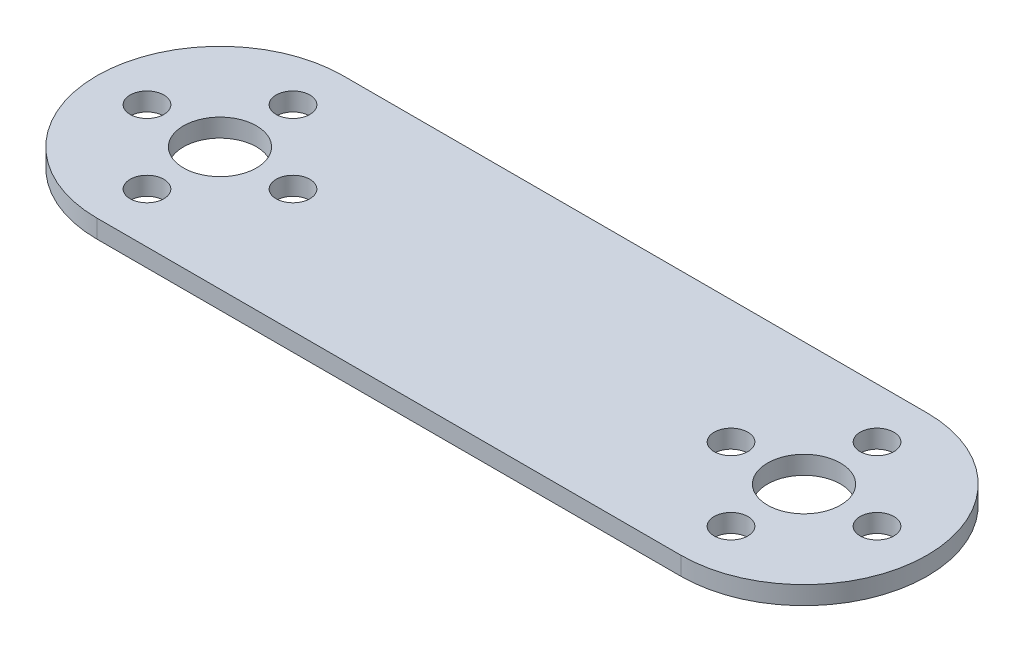
ISO-10303-21;
HEADER;
FILE_DESCRIPTION(('STEP AP214'),'2;1');
FILE_NAME('part.step','',(''),(''),'','','');
FILE_SCHEMA(('AUTOMOTIVE_DESIGN { 1 0 10303 214 1 1 1 1 }'));
ENDSEC;
DATA;
#1=APPLICATION_CONTEXT('core data for automotive mechanical design processes');
#2=APPLICATION_PROTOCOL_DEFINITION('international standard','automotive_design',2000,#1);
#3=PRODUCT_CONTEXT('',#1,'mechanical');
#4=PRODUCT('Part','Part','',(#3));
#5=PRODUCT_RELATED_PRODUCT_CATEGORY('part','',(#4));
#6=PRODUCT_DEFINITION_FORMATION('','',#4);
#7=PRODUCT_DEFINITION_CONTEXT('part definition',#1,'design');
#8=PRODUCT_DEFINITION('design','',#6,#7);
#9=PRODUCT_DEFINITION_SHAPE('','',#8);
#10=(LENGTH_UNIT() NAMED_UNIT(*) SI_UNIT(.MILLI.,.METRE.));
#11=(NAMED_UNIT(*) PLANE_ANGLE_UNIT() SI_UNIT($,.RADIAN.));
#12=(NAMED_UNIT(*) SI_UNIT($,.STERADIAN.) SOLID_ANGLE_UNIT());
#13=UNCERTAINTY_MEASURE_WITH_UNIT(LENGTH_MEASURE(1.E-05),#10,'distance_accuracy_value','');
#14=(GEOMETRIC_REPRESENTATION_CONTEXT(3) GLOBAL_UNCERTAINTY_ASSIGNED_CONTEXT((#13)) GLOBAL_UNIT_ASSIGNED_CONTEXT((#10,
#11,#12)) REPRESENTATION_CONTEXT('',''));
#15=CARTESIAN_POINT('',(0.,0.,0.));
#16=DIRECTION('',(0.,0.,1.));
#17=DIRECTION('',(1.,0.,0.));
#18=AXIS2_PLACEMENT_3D('',#15,#16,#17);
#19=CARTESIAN_POINT('',(64.,0.,0.));
#20=DIRECTION('',(0.,1.,0.));
#21=DIRECTION('',(0.,0.,1.));
#22=AXIS2_PLACEMENT_3D('',#19,#20,#21);
#23=CYLINDRICAL_SURFACE('',#22,13.5);
#24=CARTESIAN_POINT('',(64.,2.,0.));
#25=DIRECTION('',(0.,1.,0.));
#26=DIRECTION('',(0.,0.,1.));
#27=AXIS2_PLACEMENT_3D('',#24,#25,#26);
#28=CIRCLE('',#27,13.5);
#29=CARTESIAN_POINT('',(64.,2.,13.5));
#30=VERTEX_POINT('',#29);
#31=CARTESIAN_POINT('',(64.,2.,-13.5));
#32=VERTEX_POINT('',#31);
#33=EDGE_CURVE('E97',#30,#32,#28,.T.);
#34=ORIENTED_EDGE('',*,*,#33,.F.);
#35=DIRECTION('',(0.,1.,0.));
#36=VECTOR('',#35,1.);
#37=CARTESIAN_POINT('',(64.,0.,13.5));
#38=LINE('',#37,#36);
#39=CARTESIAN_POINT('',(64.,0.,13.5));
#40=VERTEX_POINT('',#39);
#41=EDGE_CURVE('E11',#40,#30,#38,.T.);
#42=ORIENTED_EDGE('',*,*,#41,.F.);
#43=CARTESIAN_POINT('',(64.,0.,0.));
#44=DIRECTION('',(0.,1.,0.));
#45=DIRECTION('',(0.,0.,1.));
#46=AXIS2_PLACEMENT_3D('',#43,#44,#45);
#47=CIRCLE('',#46,13.5);
#48=CARTESIAN_POINT('',(64.,0.,-13.5));
#49=VERTEX_POINT('',#48);
#50=EDGE_CURVE('E90',#40,#49,#47,.T.);
#51=ORIENTED_EDGE('',*,*,#50,.T.);
#52=DIRECTION('',(0.,1.,0.));
#53=VECTOR('',#52,1.);
#54=CARTESIAN_POINT('',(64.,0.,-13.5));
#55=LINE('',#54,#53);
#56=EDGE_CURVE('E35',#49,#32,#55,.T.);
#57=ORIENTED_EDGE('',*,*,#56,.T.);
#58=EDGE_LOOP('',(#34,#42,#51,#57));
#59=FACE_BOUND('',#58,.T.);
#60=ADVANCED_FACE('F32',(#59),#23,.T.);
#61=CARTESIAN_POINT('',(0.,0.,13.5));
#62=DIRECTION('',(0.,0.,1.));
#63=DIRECTION('',(1.,0.,0.));
#64=AXIS2_PLACEMENT_3D('',#61,#62,#63);
#65=PLANE('',#64);
#66=DIRECTION('',(1.,0.,0.));
#67=VECTOR('',#66,1.);
#68=CARTESIAN_POINT('',(0.,2.,13.5));
#69=LINE('',#68,#67);
#70=CARTESIAN_POINT('',(0.,2.,13.5));
#71=VERTEX_POINT('',#70);
#72=EDGE_CURVE('E92',#71,#30,#69,.T.);
#73=ORIENTED_EDGE('',*,*,#72,.F.);
#74=DIRECTION('',(0.,1.,0.));
#75=VECTOR('',#74,1.);
#76=CARTESIAN_POINT('',(0.,0.,13.5));
#77=LINE('',#76,#75);
#78=CARTESIAN_POINT('',(0.,0.,13.5));
#79=VERTEX_POINT('',#78);
#80=EDGE_CURVE('E41',#79,#71,#77,.T.);
#81=ORIENTED_EDGE('',*,*,#80,.F.);
#82=DIRECTION('',(1.,0.,0.));
#83=VECTOR('',#82,1.);
#84=CARTESIAN_POINT('',(0.,0.,13.5));
#85=LINE('',#84,#83);
#86=EDGE_CURVE('E87',#79,#40,#85,.T.);
#87=ORIENTED_EDGE('',*,*,#86,.T.);
#88=ORIENTED_EDGE('',*,*,#41,.T.);
#89=EDGE_LOOP('',(#73,#81,#87,#88));
#90=FACE_BOUND('',#89,.T.);
#91=ADVANCED_FACE('F108',(#90),#65,.T.);
#92=CARTESIAN_POINT('',(0.,0.,0.));
#93=DIRECTION('',(0.,1.,0.));
#94=DIRECTION('',(0.,0.,1.));
#95=AXIS2_PLACEMENT_3D('',#92,#93,#94);
#96=CYLINDRICAL_SURFACE('',#95,13.5);
#97=CARTESIAN_POINT('',(0.,2.,0.));
#98=DIRECTION('',(0.,1.,0.));
#99=DIRECTION('',(0.,0.,1.));
#100=AXIS2_PLACEMENT_3D('',#97,#98,#99);
#101=CIRCLE('',#100,13.5);
#102=CARTESIAN_POINT('',(0.,2.,-13.5));
#103=VERTEX_POINT('',#102);
#104=EDGE_CURVE('E82',#103,#71,#101,.T.);
#105=ORIENTED_EDGE('',*,*,#104,.F.);
#106=DIRECTION('',(0.,1.,0.));
#107=VECTOR('',#106,1.);
#108=CARTESIAN_POINT('',(0.,0.,-13.5));
#109=LINE('',#108,#107);
#110=CARTESIAN_POINT('',(0.,0.,-13.5));
#111=VERTEX_POINT('',#110);
#112=EDGE_CURVE('E77',#111,#103,#109,.T.);
#113=ORIENTED_EDGE('',*,*,#112,.F.);
#114=CARTESIAN_POINT('',(0.,0.,0.));
#115=DIRECTION('',(0.,1.,0.));
#116=DIRECTION('',(0.,0.,1.));
#117=AXIS2_PLACEMENT_3D('',#114,#115,#116);
#118=CIRCLE('',#117,13.5);
#119=EDGE_CURVE('E80',#111,#79,#118,.T.);
#120=ORIENTED_EDGE('',*,*,#119,.T.);
#121=ORIENTED_EDGE('',*,*,#80,.T.);
#122=EDGE_LOOP('',(#105,#113,#120,#121));
#123=FACE_BOUND('',#122,.T.);
#124=ADVANCED_FACE('F79',(#123),#96,.T.);
#125=CARTESIAN_POINT('',(64.,0.,-13.5));
#126=DIRECTION('',(0.,0.,-1.));
#127=DIRECTION('',(-1.,0.,0.));
#128=AXIS2_PLACEMENT_3D('',#125,#126,#127);
#129=PLANE('',#128);
#130=DIRECTION('',(-1.,0.,0.));
#131=VECTOR('',#130,1.);
#132=CARTESIAN_POINT('',(64.,2.,-13.5));
#133=LINE('',#132,#131);
#134=EDGE_CURVE('E100',#32,#103,#133,.T.);
#135=ORIENTED_EDGE('',*,*,#134,.F.);
#136=ORIENTED_EDGE('',*,*,#56,.F.);
#137=DIRECTION('',(-1.,0.,0.));
#138=VECTOR('',#137,1.);
#139=CARTESIAN_POINT('',(64.,0.,-13.5));
#140=LINE('',#139,#138);
#141=EDGE_CURVE('E86',#49,#111,#140,.T.);
#142=ORIENTED_EDGE('',*,*,#141,.T.);
#143=ORIENTED_EDGE('',*,*,#112,.T.);
#144=EDGE_LOOP('',(#135,#136,#142,#143));
#145=FACE_BOUND('',#144,.T.);
#146=ADVANCED_FACE('F89',(#145),#129,.T.);
#147=CARTESIAN_POINT('',(64.,0.,0.));
#148=DIRECTION('',(0.,1.,0.));
#149=DIRECTION('',(0.,0.,1.));
#150=AXIS2_PLACEMENT_3D('',#147,#148,#149);
#151=PLANE('',#150);
#152=CARTESIAN_POINT('',(0.,0.,0.));
#153=DIRECTION('',(0.,1.,0.));
#154=DIRECTION('',(0.,0.,-1.));
#155=AXIS2_PLACEMENT_3D('',#152,#153,#154);
#156=CIRCLE('',#155,4.);
#157=CARTESIAN_POINT('',(0.,0.,-4.));
#158=VERTEX_POINT('',#157);
#159=EDGE_CURVE('E173',#158,#158,#156,.T.);
#160=ORIENTED_EDGE('',*,*,#159,.T.);
#161=EDGE_LOOP('',(#160));
#162=FACE_BOUND('',#161,.T.);
#163=CARTESIAN_POINT('',(0.,0.,-8.));
#164=DIRECTION('',(0.,1.,0.));
#165=DIRECTION('',(0.,0.,-1.));
#166=AXIS2_PLACEMENT_3D('',#163,#164,#165);
#167=CIRCLE('',#166,1.85);
#168=CARTESIAN_POINT('',(0.,0.,-9.85));
#169=VERTEX_POINT('',#168);
#170=EDGE_CURVE('E181',#169,#169,#167,.T.);
#171=ORIENTED_EDGE('',*,*,#170,.T.);
#172=EDGE_LOOP('',(#171));
#173=FACE_BOUND('',#172,.T.);
#174=CARTESIAN_POINT('',(8.,0.,0.));
#175=DIRECTION('',(0.,1.,0.));
#176=DIRECTION('',(0.,0.,-1.));
#177=AXIS2_PLACEMENT_3D('',#174,#175,#176);
#178=CIRCLE('',#177,1.85);
#179=CARTESIAN_POINT('',(8.,0.,-1.85));
#180=VERTEX_POINT('',#179);
#181=EDGE_CURVE('E187',#180,#180,#178,.T.);
#182=ORIENTED_EDGE('',*,*,#181,.T.);
#183=EDGE_LOOP('',(#182));
#184=FACE_BOUND('',#183,.T.);
#185=CARTESIAN_POINT('',(0.,0.,8.));
#186=DIRECTION('',(0.,1.,0.));
#187=DIRECTION('',(0.,0.,-1.));
#188=AXIS2_PLACEMENT_3D('',#185,#186,#187);
#189=CIRCLE('',#188,1.85);
#190=CARTESIAN_POINT('',(0.,0.,6.15));
#191=VERTEX_POINT('',#190);
#192=EDGE_CURVE('E193',#191,#191,#189,.T.);
#193=ORIENTED_EDGE('',*,*,#192,.T.);
#194=EDGE_LOOP('',(#193));
#195=FACE_BOUND('',#194,.T.);
#196=CARTESIAN_POINT('',(-8.,0.,0.));
#197=DIRECTION('',(0.,1.,0.));
#198=DIRECTION('',(0.,0.,-1.));
#199=AXIS2_PLACEMENT_3D('',#196,#197,#198);
#200=CIRCLE('',#199,1.85);
#201=CARTESIAN_POINT('',(-8.,0.,-1.85));
#202=VERTEX_POINT('',#201);
#203=EDGE_CURVE('E199',#202,#202,#200,.T.);
#204=ORIENTED_EDGE('',*,*,#203,.T.);
#205=EDGE_LOOP('',(#204));
#206=FACE_BOUND('',#205,.T.);
#207=CARTESIAN_POINT('',(64.,0.,0.));
#208=DIRECTION('',(0.,1.,0.));
#209=DIRECTION('',(0.,0.,-1.));
#210=AXIS2_PLACEMENT_3D('',#207,#208,#209);
#211=CIRCLE('',#210,4.);
#212=CARTESIAN_POINT('',(64.,0.,-4.));
#213=VERTEX_POINT('',#212);
#214=EDGE_CURVE('E205',#213,#213,#211,.T.);
#215=ORIENTED_EDGE('',*,*,#214,.T.);
#216=EDGE_LOOP('',(#215));
#217=FACE_BOUND('',#216,.T.);
#218=CARTESIAN_POINT('',(64.,0.,-8.));
#219=DIRECTION('',(0.,1.,0.));
#220=DIRECTION('',(0.,0.,-1.));
#221=AXIS2_PLACEMENT_3D('',#218,#219,#220);
#222=CIRCLE('',#221,1.85);
#223=CARTESIAN_POINT('',(64.,0.,-9.85));
#224=VERTEX_POINT('',#223);
#225=EDGE_CURVE('E211',#224,#224,#222,.T.);
#226=ORIENTED_EDGE('',*,*,#225,.T.);
#227=EDGE_LOOP('',(#226));
#228=FACE_BOUND('',#227,.T.);
#229=CARTESIAN_POINT('',(72.,0.,0.));
#230=DIRECTION('',(0.,1.,0.));
#231=DIRECTION('',(0.,0.,-1.));
#232=AXIS2_PLACEMENT_3D('',#229,#230,#231);
#233=CIRCLE('',#232,1.85);
#234=CARTESIAN_POINT('',(72.,0.,-1.85));
#235=VERTEX_POINT('',#234);
#236=EDGE_CURVE('E217',#235,#235,#233,.T.);
#237=ORIENTED_EDGE('',*,*,#236,.T.);
#238=EDGE_LOOP('',(#237));
#239=FACE_BOUND('',#238,.T.);
#240=CARTESIAN_POINT('',(64.,0.,8.));
#241=DIRECTION('',(0.,1.,0.));
#242=DIRECTION('',(0.,0.,-1.));
#243=AXIS2_PLACEMENT_3D('',#240,#241,#242);
#244=CIRCLE('',#243,1.85);
#245=CARTESIAN_POINT('',(64.,0.,6.15));
#246=VERTEX_POINT('',#245);
#247=EDGE_CURVE('E223',#246,#246,#244,.T.);
#248=ORIENTED_EDGE('',*,*,#247,.T.);
#249=EDGE_LOOP('',(#248));
#250=FACE_BOUND('',#249,.T.);
#251=CARTESIAN_POINT('',(56.,0.,0.));
#252=DIRECTION('',(0.,1.,0.));
#253=DIRECTION('',(0.,0.,-1.));
#254=AXIS2_PLACEMENT_3D('',#251,#252,#253);
#255=CIRCLE('',#254,1.85);
#256=CARTESIAN_POINT('',(56.,0.,-1.85));
#257=VERTEX_POINT('',#256);
#258=EDGE_CURVE('E101',#257,#257,#255,.T.);
#259=ORIENTED_EDGE('',*,*,#258,.T.);
#260=EDGE_LOOP('',(#259));
#261=FACE_BOUND('',#260,.T.);
#262=ORIENTED_EDGE('',*,*,#50,.F.);
#263=ORIENTED_EDGE('',*,*,#86,.F.);
#264=ORIENTED_EDGE('',*,*,#119,.F.);
#265=ORIENTED_EDGE('',*,*,#141,.F.);
#266=EDGE_LOOP('',(#262,#263,#264,#265));
#267=FACE_BOUND('',#266,.T.);
#268=ADVANCED_FACE('F85',(#162,#173,#184,#195,#206,#217,#228,#239,#250,#261,#267),#151,.F.);
#269=CARTESIAN_POINT('',(64.,2.,0.));
#270=DIRECTION('',(0.,1.,0.));
#271=DIRECTION('',(0.,0.,1.));
#272=AXIS2_PLACEMENT_3D('',#269,#270,#271);
#273=PLANE('',#272);
#274=CARTESIAN_POINT('',(0.,2.,0.));
#275=DIRECTION('',(0.,1.,0.));
#276=DIRECTION('',(0.,0.,-1.));
#277=AXIS2_PLACEMENT_3D('',#274,#275,#276);
#278=CIRCLE('',#277,4.);
#279=CARTESIAN_POINT('',(0.,2.,-4.));
#280=VERTEX_POINT('',#279);
#281=EDGE_CURVE('E176',#280,#280,#278,.T.);
#282=ORIENTED_EDGE('',*,*,#281,.F.);
#283=EDGE_LOOP('',(#282));
#284=FACE_BOUND('',#283,.T.);
#285=CARTESIAN_POINT('',(0.,2.,-8.));
#286=DIRECTION('',(0.,1.,0.));
#287=DIRECTION('',(0.,0.,-1.));
#288=AXIS2_PLACEMENT_3D('',#285,#286,#287);
#289=CIRCLE('',#288,1.85);
#290=CARTESIAN_POINT('',(0.,2.,-9.85));
#291=VERTEX_POINT('',#290);
#292=EDGE_CURVE('E178',#291,#291,#289,.T.);
#293=ORIENTED_EDGE('',*,*,#292,.F.);
#294=EDGE_LOOP('',(#293));
#295=FACE_BOUND('',#294,.T.);
#296=CARTESIAN_POINT('',(8.,2.,0.));
#297=DIRECTION('',(0.,1.,0.));
#298=DIRECTION('',(0.,0.,-1.));
#299=AXIS2_PLACEMENT_3D('',#296,#297,#298);
#300=CIRCLE('',#299,1.85);
#301=CARTESIAN_POINT('',(8.,2.,-1.85));
#302=VERTEX_POINT('',#301);
#303=EDGE_CURVE('E184',#302,#302,#300,.T.);
#304=ORIENTED_EDGE('',*,*,#303,.F.);
#305=EDGE_LOOP('',(#304));
#306=FACE_BOUND('',#305,.T.);
#307=CARTESIAN_POINT('',(0.,2.,8.));
#308=DIRECTION('',(0.,1.,0.));
#309=DIRECTION('',(0.,0.,-1.));
#310=AXIS2_PLACEMENT_3D('',#307,#308,#309);
#311=CIRCLE('',#310,1.85);
#312=CARTESIAN_POINT('',(0.,2.,6.15));
#313=VERTEX_POINT('',#312);
#314=EDGE_CURVE('E190',#313,#313,#311,.T.);
#315=ORIENTED_EDGE('',*,*,#314,.F.);
#316=EDGE_LOOP('',(#315));
#317=FACE_BOUND('',#316,.T.);
#318=CARTESIAN_POINT('',(-8.,2.,0.));
#319=DIRECTION('',(0.,1.,0.));
#320=DIRECTION('',(0.,0.,-1.));
#321=AXIS2_PLACEMENT_3D('',#318,#319,#320);
#322=CIRCLE('',#321,1.85);
#323=CARTESIAN_POINT('',(-8.,2.,-1.85));
#324=VERTEX_POINT('',#323);
#325=EDGE_CURVE('E196',#324,#324,#322,.T.);
#326=ORIENTED_EDGE('',*,*,#325,.F.);
#327=EDGE_LOOP('',(#326));
#328=FACE_BOUND('',#327,.T.);
#329=CARTESIAN_POINT('',(64.,2.,0.));
#330=DIRECTION('',(0.,1.,0.));
#331=DIRECTION('',(0.,0.,-1.));
#332=AXIS2_PLACEMENT_3D('',#329,#330,#331);
#333=CIRCLE('',#332,4.);
#334=CARTESIAN_POINT('',(64.,2.,-4.));
#335=VERTEX_POINT('',#334);
#336=EDGE_CURVE('E202',#335,#335,#333,.T.);
#337=ORIENTED_EDGE('',*,*,#336,.F.);
#338=EDGE_LOOP('',(#337));
#339=FACE_BOUND('',#338,.T.);
#340=CARTESIAN_POINT('',(64.,2.,-8.));
#341=DIRECTION('',(0.,1.,0.));
#342=DIRECTION('',(0.,0.,-1.));
#343=AXIS2_PLACEMENT_3D('',#340,#341,#342);
#344=CIRCLE('',#343,1.85);
#345=CARTESIAN_POINT('',(64.,2.,-9.85));
#346=VERTEX_POINT('',#345);
#347=EDGE_CURVE('E208',#346,#346,#344,.T.);
#348=ORIENTED_EDGE('',*,*,#347,.F.);
#349=EDGE_LOOP('',(#348));
#350=FACE_BOUND('',#349,.T.);
#351=CARTESIAN_POINT('',(72.,2.,0.));
#352=DIRECTION('',(0.,1.,0.));
#353=DIRECTION('',(0.,0.,-1.));
#354=AXIS2_PLACEMENT_3D('',#351,#352,#353);
#355=CIRCLE('',#354,1.85);
#356=CARTESIAN_POINT('',(72.,2.,-1.85));
#357=VERTEX_POINT('',#356);
#358=EDGE_CURVE('E214',#357,#357,#355,.T.);
#359=ORIENTED_EDGE('',*,*,#358,.F.);
#360=EDGE_LOOP('',(#359));
#361=FACE_BOUND('',#360,.T.);
#362=CARTESIAN_POINT('',(64.,2.,8.));
#363=DIRECTION('',(0.,1.,0.));
#364=DIRECTION('',(0.,0.,-1.));
#365=AXIS2_PLACEMENT_3D('',#362,#363,#364);
#366=CIRCLE('',#365,1.85);
#367=CARTESIAN_POINT('',(64.,2.,6.15));
#368=VERTEX_POINT('',#367);
#369=EDGE_CURVE('E220',#368,#368,#366,.T.);
#370=ORIENTED_EDGE('',*,*,#369,.F.);
#371=EDGE_LOOP('',(#370));
#372=FACE_BOUND('',#371,.T.);
#373=CARTESIAN_POINT('',(56.,2.,0.));
#374=DIRECTION('',(0.,1.,0.));
#375=DIRECTION('',(0.,0.,-1.));
#376=AXIS2_PLACEMENT_3D('',#373,#374,#375);
#377=CIRCLE('',#376,1.85);
#378=CARTESIAN_POINT('',(56.,2.,-1.85));
#379=VERTEX_POINT('',#378);
#380=EDGE_CURVE('E226',#379,#379,#377,.T.);
#381=ORIENTED_EDGE('',*,*,#380,.F.);
#382=EDGE_LOOP('',(#381));
#383=FACE_BOUND('',#382,.T.);
#384=ORIENTED_EDGE('',*,*,#33,.T.);
#385=ORIENTED_EDGE('',*,*,#134,.T.);
#386=ORIENTED_EDGE('',*,*,#104,.T.);
#387=ORIENTED_EDGE('',*,*,#72,.T.);
#388=EDGE_LOOP('',(#384,#385,#386,#387));
#389=FACE_BOUND('',#388,.T.);
#390=ADVANCED_FACE('F107',(#284,#295,#306,#317,#328,#339,#350,#361,#372,#383,#389),#273,.T.);
#391=CARTESIAN_POINT('',(56.,0.,0.));
#392=DIRECTION('',(0.,1.,0.));
#393=DIRECTION('',(0.,0.,1.));
#394=AXIS2_PLACEMENT_3D('',#391,#392,#393);
#395=CYLINDRICAL_SURFACE('',#394,1.85);
#396=ORIENTED_EDGE('',*,*,#258,.F.);
#397=EDGE_LOOP('',(#396));
#398=FACE_BOUND('',#397,.T.);
#399=ORIENTED_EDGE('',*,*,#380,.T.);
#400=EDGE_LOOP('',(#399));
#401=FACE_BOUND('',#400,.T.);
#402=ADVANCED_FACE('F126',(#398,#401),#395,.F.);
#403=CARTESIAN_POINT('',(64.,0.,8.));
#404=DIRECTION('',(0.,1.,0.));
#405=DIRECTION('',(0.,0.,1.));
#406=AXIS2_PLACEMENT_3D('',#403,#404,#405);
#407=CYLINDRICAL_SURFACE('',#406,1.85);
#408=ORIENTED_EDGE('',*,*,#247,.F.);
#409=EDGE_LOOP('',(#408));
#410=FACE_BOUND('',#409,.T.);
#411=ORIENTED_EDGE('',*,*,#369,.T.);
#412=EDGE_LOOP('',(#411));
#413=FACE_BOUND('',#412,.T.);
#414=ADVANCED_FACE('F133',(#410,#413),#407,.F.);
#415=CARTESIAN_POINT('',(72.,0.,0.));
#416=DIRECTION('',(0.,1.,0.));
#417=DIRECTION('',(0.,0.,1.));
#418=AXIS2_PLACEMENT_3D('',#415,#416,#417);
#419=CYLINDRICAL_SURFACE('',#418,1.85);
#420=ORIENTED_EDGE('',*,*,#236,.F.);
#421=EDGE_LOOP('',(#420));
#422=FACE_BOUND('',#421,.T.);
#423=ORIENTED_EDGE('',*,*,#358,.T.);
#424=EDGE_LOOP('',(#423));
#425=FACE_BOUND('',#424,.T.);
#426=ADVANCED_FACE('F137',(#422,#425),#419,.F.);
#427=CARTESIAN_POINT('',(64.,0.,-8.));
#428=DIRECTION('',(0.,1.,0.));
#429=DIRECTION('',(0.,0.,1.));
#430=AXIS2_PLACEMENT_3D('',#427,#428,#429);
#431=CYLINDRICAL_SURFACE('',#430,1.85);
#432=ORIENTED_EDGE('',*,*,#225,.F.);
#433=EDGE_LOOP('',(#432));
#434=FACE_BOUND('',#433,.T.);
#435=ORIENTED_EDGE('',*,*,#347,.T.);
#436=EDGE_LOOP('',(#435));
#437=FACE_BOUND('',#436,.T.);
#438=ADVANCED_FACE('F141',(#434,#437),#431,.F.);
#439=CARTESIAN_POINT('',(64.,0.,0.));
#440=DIRECTION('',(0.,1.,0.));
#441=DIRECTION('',(0.,0.,1.));
#442=AXIS2_PLACEMENT_3D('',#439,#440,#441);
#443=CYLINDRICAL_SURFACE('',#442,4.);
#444=ORIENTED_EDGE('',*,*,#214,.F.);
#445=EDGE_LOOP('',(#444));
#446=FACE_BOUND('',#445,.T.);
#447=ORIENTED_EDGE('',*,*,#336,.T.);
#448=EDGE_LOOP('',(#447));
#449=FACE_BOUND('',#448,.T.);
#450=ADVANCED_FACE('F145',(#446,#449),#443,.F.);
#451=CARTESIAN_POINT('',(-8.,0.,0.));
#452=DIRECTION('',(0.,1.,0.));
#453=DIRECTION('',(0.,0.,1.));
#454=AXIS2_PLACEMENT_3D('',#451,#452,#453);
#455=CYLINDRICAL_SURFACE('',#454,1.85);
#456=ORIENTED_EDGE('',*,*,#203,.F.);
#457=EDGE_LOOP('',(#456));
#458=FACE_BOUND('',#457,.T.);
#459=ORIENTED_EDGE('',*,*,#325,.T.);
#460=EDGE_LOOP('',(#459));
#461=FACE_BOUND('',#460,.T.);
#462=ADVANCED_FACE('F149',(#458,#461),#455,.F.);
#463=CARTESIAN_POINT('',(0.,0.,8.));
#464=DIRECTION('',(0.,1.,0.));
#465=DIRECTION('',(0.,0.,1.));
#466=AXIS2_PLACEMENT_3D('',#463,#464,#465);
#467=CYLINDRICAL_SURFACE('',#466,1.85);
#468=ORIENTED_EDGE('',*,*,#192,.F.);
#469=EDGE_LOOP('',(#468));
#470=FACE_BOUND('',#469,.T.);
#471=ORIENTED_EDGE('',*,*,#314,.T.);
#472=EDGE_LOOP('',(#471));
#473=FACE_BOUND('',#472,.T.);
#474=ADVANCED_FACE('F153',(#470,#473),#467,.F.);
#475=CARTESIAN_POINT('',(8.,0.,0.));
#476=DIRECTION('',(0.,1.,0.));
#477=DIRECTION('',(0.,0.,1.));
#478=AXIS2_PLACEMENT_3D('',#475,#476,#477);
#479=CYLINDRICAL_SURFACE('',#478,1.85);
#480=ORIENTED_EDGE('',*,*,#181,.F.);
#481=EDGE_LOOP('',(#480));
#482=FACE_BOUND('',#481,.T.);
#483=ORIENTED_EDGE('',*,*,#303,.T.);
#484=EDGE_LOOP('',(#483));
#485=FACE_BOUND('',#484,.T.);
#486=ADVANCED_FACE('F157',(#482,#485),#479,.F.);
#487=CARTESIAN_POINT('',(0.,0.,-8.));
#488=DIRECTION('',(0.,1.,0.));
#489=DIRECTION('',(0.,0.,1.));
#490=AXIS2_PLACEMENT_3D('',#487,#488,#489);
#491=CYLINDRICAL_SURFACE('',#490,1.85);
#492=ORIENTED_EDGE('',*,*,#170,.F.);
#493=EDGE_LOOP('',(#492));
#494=FACE_BOUND('',#493,.T.);
#495=ORIENTED_EDGE('',*,*,#292,.T.);
#496=EDGE_LOOP('',(#495));
#497=FACE_BOUND('',#496,.T.);
#498=ADVANCED_FACE('F161',(#494,#497),#491,.F.);
#499=CARTESIAN_POINT('',(0.,0.,0.));
#500=DIRECTION('',(0.,1.,0.));
#501=DIRECTION('',(0.,0.,1.));
#502=AXIS2_PLACEMENT_3D('',#499,#500,#501);
#503=CYLINDRICAL_SURFACE('',#502,4.);
#504=ORIENTED_EDGE('',*,*,#159,.F.);
#505=EDGE_LOOP('',(#504));
#506=FACE_BOUND('',#505,.T.);
#507=ORIENTED_EDGE('',*,*,#281,.T.);
#508=EDGE_LOOP('',(#507));
#509=FACE_BOUND('',#508,.T.);
#510=ADVANCED_FACE('F165',(#506,#509),#503,.F.);
#511=CLOSED_SHELL('',(#60,#91,#124,#146,#268,#390,#402,#414,#426,#438,#450,#462,#474,#486,#498,#510));
#512=MANIFOLD_SOLID_BREP('B2',#511);
#513=ADVANCED_BREP_SHAPE_REPRESENTATION('',(#18,#512),#14);
#514=SHAPE_DEFINITION_REPRESENTATION(#9,#513);
ENDSEC;
END-ISO-10303-21;
